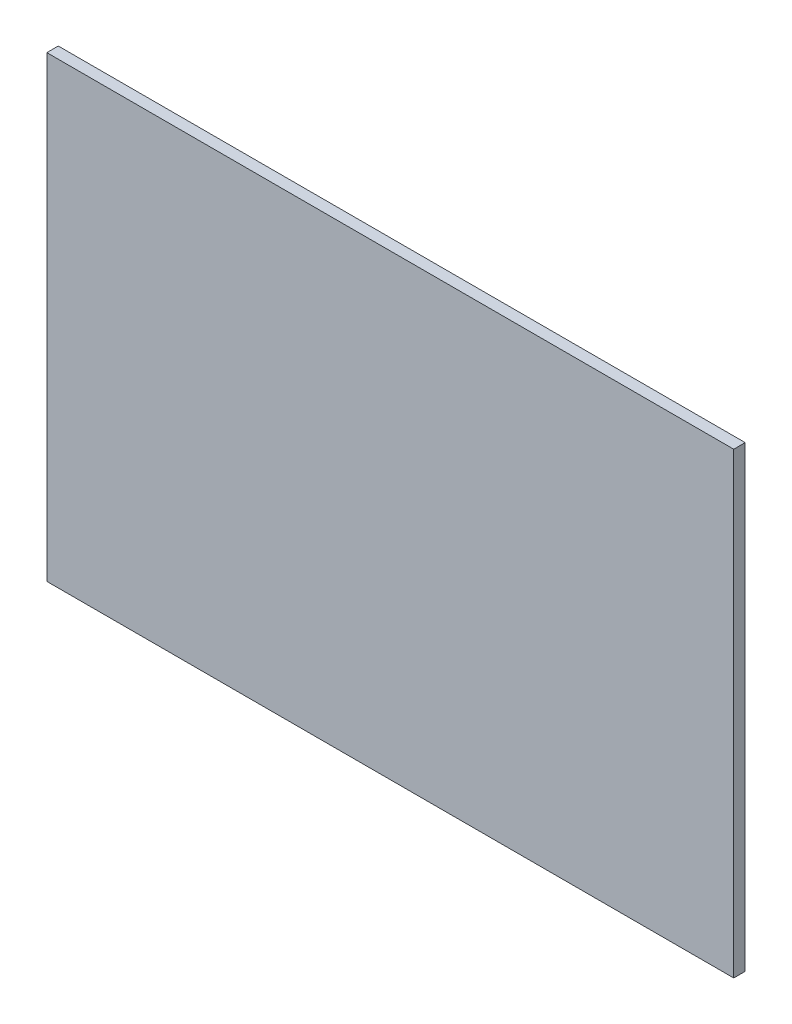
ISO-10303-21;
HEADER;
FILE_DESCRIPTION(('STEP AP214'),'2;1');
FILE_NAME('part.step','',(''),(''),'','','');
FILE_SCHEMA(('AUTOMOTIVE_DESIGN { 1 0 10303 214 1 1 1 1 }'));
ENDSEC;
DATA;
#1=APPLICATION_CONTEXT('core data for automotive mechanical design processes');
#2=APPLICATION_PROTOCOL_DEFINITION('international standard','automotive_design',2000,#1);
#3=PRODUCT_CONTEXT('',#1,'mechanical');
#4=PRODUCT('Part','Part','',(#3));
#5=PRODUCT_RELATED_PRODUCT_CATEGORY('part','',(#4));
#6=PRODUCT_DEFINITION_FORMATION('','',#4);
#7=PRODUCT_DEFINITION_CONTEXT('part definition',#1,'design');
#8=PRODUCT_DEFINITION('design','',#6,#7);
#9=PRODUCT_DEFINITION_SHAPE('','',#8);
#10=(LENGTH_UNIT() NAMED_UNIT(*) SI_UNIT(.MILLI.,.METRE.));
#11=(NAMED_UNIT(*) PLANE_ANGLE_UNIT() SI_UNIT($,.RADIAN.));
#12=(NAMED_UNIT(*) SI_UNIT($,.STERADIAN.) SOLID_ANGLE_UNIT());
#13=UNCERTAINTY_MEASURE_WITH_UNIT(LENGTH_MEASURE(1.E-05),#10,'distance_accuracy_value','');
#14=(GEOMETRIC_REPRESENTATION_CONTEXT(3) GLOBAL_UNCERTAINTY_ASSIGNED_CONTEXT((#13)) GLOBAL_UNIT_ASSIGNED_CONTEXT((#10,
#11,#12)) REPRESENTATION_CONTEXT('',''));
#15=CARTESIAN_POINT('',(0.,0.,0.));
#16=DIRECTION('',(0.,0.,1.));
#17=DIRECTION('',(1.,0.,0.));
#18=AXIS2_PLACEMENT_3D('',#15,#16,#17);
#19=CARTESIAN_POINT('',(-67.8416193726221,189.780663506483,5.));
#20=DIRECTION('',(1.,0.,0.));
#21=DIRECTION('',(0.,1.,0.));
#22=AXIS2_PLACEMENT_3D('',#19,#20,#21);
#23=PLANE('',#22);
#24=DIRECTION('',(0.,-1.,0.));
#25=VECTOR('',#24,1.);
#26=CARTESIAN_POINT('',(-67.8416193726221,189.780663506483,0.));
#27=LINE('',#26,#25);
#28=CARTESIAN_POINT('',(-67.8416193726221,189.780663506483,0.));
#29=VERTEX_POINT('',#28);
#30=CARTESIAN_POINT('',(-67.8416193726221,-10.2193364935166,0.));
#31=VERTEX_POINT('',#30);
#32=EDGE_CURVE('E96',#29,#31,#27,.T.);
#33=ORIENTED_EDGE('',*,*,#32,.T.);
#34=DIRECTION('',(0.,0.,-1.));
#35=VECTOR('',#34,1.);
#36=CARTESIAN_POINT('',(-67.8416193726221,-10.2193364935166,5.));
#37=LINE('',#36,#35);
#38=CARTESIAN_POINT('',(-67.8416193726221,-10.2193364935166,5.));
#39=VERTEX_POINT('',#38);
#40=EDGE_CURVE('E11',#39,#31,#37,.T.);
#41=ORIENTED_EDGE('',*,*,#40,.F.);
#42=DIRECTION('',(0.,-1.,0.));
#43=VECTOR('',#42,1.);
#44=CARTESIAN_POINT('',(-67.8416193726221,189.780663506483,5.));
#45=LINE('',#44,#43);
#46=CARTESIAN_POINT('',(-67.8416193726221,189.780663506483,5.));
#47=VERTEX_POINT('',#46);
#48=EDGE_CURVE('E84',#47,#39,#45,.T.);
#49=ORIENTED_EDGE('',*,*,#48,.F.);
#50=DIRECTION('',(0.,0.,-1.));
#51=VECTOR('',#50,1.);
#52=CARTESIAN_POINT('',(-67.8416193726221,189.780663506483,5.));
#53=LINE('',#52,#51);
#54=EDGE_CURVE('E92',#47,#29,#53,.T.);
#55=ORIENTED_EDGE('',*,*,#54,.T.);
#56=EDGE_LOOP('',(#33,#41,#49,#55));
#57=FACE_BOUND('',#56,.T.);
#58=ADVANCED_FACE('F33',(#57),#23,.F.);
#59=CARTESIAN_POINT('',(-67.8416193726221,-10.2193364935166,5.));
#60=DIRECTION('',(0.,1.,0.));
#61=DIRECTION('',(0.,0.,1.));
#62=AXIS2_PLACEMENT_3D('',#59,#60,#61);
#63=PLANE('',#62);
#64=DIRECTION('',(1.,0.,0.));
#65=VECTOR('',#64,1.);
#66=CARTESIAN_POINT('',(-67.8416193726221,-10.2193364935166,0.));
#67=LINE('',#66,#65);
#68=CARTESIAN_POINT('',(232.158380627378,-10.2193364935166,0.));
#69=VERTEX_POINT('',#68);
#70=EDGE_CURVE('E88',#31,#69,#67,.T.);
#71=ORIENTED_EDGE('',*,*,#70,.T.);
#72=DIRECTION('',(0.,0.,-1.));
#73=VECTOR('',#72,1.);
#74=CARTESIAN_POINT('',(232.158380627378,-10.2193364935166,5.));
#75=LINE('',#74,#73);
#76=CARTESIAN_POINT('',(232.158380627378,-10.2193364935166,5.));
#77=VERTEX_POINT('',#76);
#78=EDGE_CURVE('E41',#77,#69,#75,.T.);
#79=ORIENTED_EDGE('',*,*,#78,.F.);
#80=DIRECTION('',(1.,0.,0.));
#81=VECTOR('',#80,1.);
#82=CARTESIAN_POINT('',(-67.8416193726221,-10.2193364935166,5.));
#83=LINE('',#82,#81);
#84=EDGE_CURVE('E79',#39,#77,#83,.T.);
#85=ORIENTED_EDGE('',*,*,#84,.F.);
#86=ORIENTED_EDGE('',*,*,#40,.T.);
#87=EDGE_LOOP('',(#71,#79,#85,#86));
#88=FACE_BOUND('',#87,.T.);
#89=ADVANCED_FACE('F87',(#88),#63,.F.);
#90=CARTESIAN_POINT('',(232.158380627378,189.780663506483,5.));
#91=DIRECTION('',(-1.,0.,0.));
#92=DIRECTION('',(0.,0.,1.));
#93=AXIS2_PLACEMENT_3D('',#90,#91,#92);
#94=PLANE('',#93);
#95=DIRECTION('',(0.,1.,0.));
#96=VECTOR('',#95,1.);
#97=CARTESIAN_POINT('',(232.158380627378,189.780663506483,0.));
#98=LINE('',#97,#96);
#99=CARTESIAN_POINT('',(232.158380627378,189.780663506483,0.));
#100=VERTEX_POINT('',#99);
#101=EDGE_CURVE('E66',#69,#100,#98,.T.);
#102=ORIENTED_EDGE('',*,*,#101,.T.);
#103=DIRECTION('',(0.,0.,-1.));
#104=VECTOR('',#103,1.);
#105=CARTESIAN_POINT('',(232.158380627378,189.780663506483,5.));
#106=LINE('',#105,#104);
#107=CARTESIAN_POINT('',(232.158380627378,189.780663506483,5.));
#108=VERTEX_POINT('',#107);
#109=EDGE_CURVE('E89',#108,#100,#106,.T.);
#110=ORIENTED_EDGE('',*,*,#109,.F.);
#111=DIRECTION('',(0.,1.,0.));
#112=VECTOR('',#111,1.);
#113=CARTESIAN_POINT('',(232.158380627378,189.780663506483,5.));
#114=LINE('',#113,#112);
#115=EDGE_CURVE('E82',#77,#108,#114,.T.);
#116=ORIENTED_EDGE('',*,*,#115,.F.);
#117=ORIENTED_EDGE('',*,*,#78,.T.);
#118=EDGE_LOOP('',(#102,#110,#116,#117));
#119=FACE_BOUND('',#118,.T.);
#120=ADVANCED_FACE('F90',(#119),#94,.F.);
#121=CARTESIAN_POINT('',(-67.8416193726221,189.780663506483,5.));
#122=DIRECTION('',(0.,-1.,0.));
#123=DIRECTION('',(0.,0.,-1.));
#124=AXIS2_PLACEMENT_3D('',#121,#122,#123);
#125=PLANE('',#124);
#126=DIRECTION('',(-1.,0.,0.));
#127=VECTOR('',#126,1.);
#128=CARTESIAN_POINT('',(-67.8416193726221,189.780663506483,0.));
#129=LINE('',#128,#127);
#130=EDGE_CURVE('E72',#100,#29,#129,.T.);
#131=ORIENTED_EDGE('',*,*,#130,.T.);
#132=ORIENTED_EDGE('',*,*,#54,.F.);
#133=DIRECTION('',(-1.,0.,0.));
#134=VECTOR('',#133,1.);
#135=CARTESIAN_POINT('',(-67.8416193726221,189.780663506483,5.));
#136=LINE('',#135,#134);
#137=EDGE_CURVE('E49',#108,#47,#136,.T.);
#138=ORIENTED_EDGE('',*,*,#137,.F.);
#139=ORIENTED_EDGE('',*,*,#109,.T.);
#140=EDGE_LOOP('',(#131,#132,#138,#139));
#141=FACE_BOUND('',#140,.T.);
#142=ADVANCED_FACE('F103',(#141),#125,.F.);
#143=CARTESIAN_POINT('',(0.,0.,5.));
#144=DIRECTION('',(0.,0.,1.));
#145=DIRECTION('',(1.,0.,0.));
#146=AXIS2_PLACEMENT_3D('',#143,#144,#145);
#147=PLANE('',#146);
#148=ORIENTED_EDGE('',*,*,#48,.T.);
#149=ORIENTED_EDGE('',*,*,#84,.T.);
#150=ORIENTED_EDGE('',*,*,#115,.T.);
#151=ORIENTED_EDGE('',*,*,#137,.T.);
#152=EDGE_LOOP('',(#148,#149,#150,#151));
#153=FACE_BOUND('',#152,.T.);
#154=ADVANCED_FACE('F80',(#153),#147,.T.);
#155=CARTESIAN_POINT('',(0.,0.,0.));
#156=DIRECTION('',(0.,0.,1.));
#157=DIRECTION('',(1.,0.,0.));
#158=AXIS2_PLACEMENT_3D('',#155,#156,#157);
#159=PLANE('',#158);
#160=ORIENTED_EDGE('',*,*,#32,.F.);
#161=ORIENTED_EDGE('',*,*,#130,.F.);
#162=ORIENTED_EDGE('',*,*,#101,.F.);
#163=ORIENTED_EDGE('',*,*,#70,.F.);
#164=EDGE_LOOP('',(#160,#161,#162,#163));
#165=FACE_BOUND('',#164,.T.);
#166=ADVANCED_FACE('F106',(#165),#159,.F.);
#167=CLOSED_SHELL('',(#58,#89,#120,#142,#154,#166));
#168=MANIFOLD_SOLID_BREP('B2',#167);
#169=ADVANCED_BREP_SHAPE_REPRESENTATION('',(#18,#168),#14);
#170=SHAPE_DEFINITION_REPRESENTATION(#9,#169);
ENDSEC;
END-ISO-10303-21;
